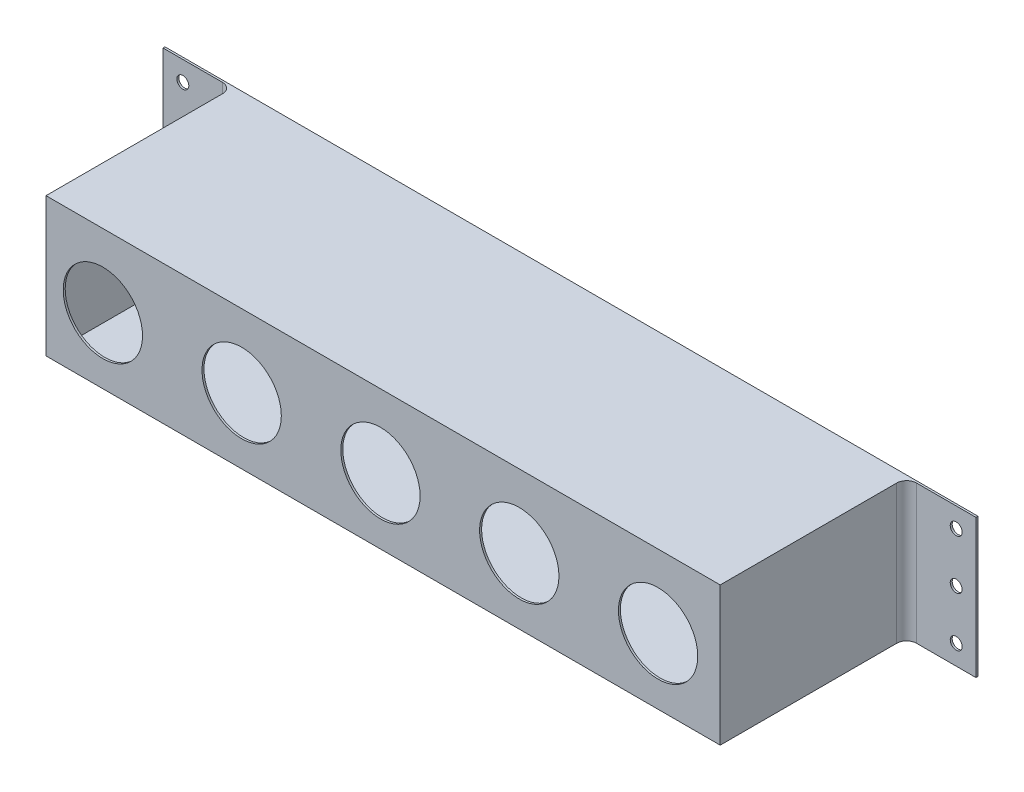
ISO-10303-21;
HEADER;
FILE_DESCRIPTION(('STEP AP214'),'2;1');
FILE_NAME('part.step','',(''),(''),'','','');
FILE_SCHEMA(('AUTOMOTIVE_DESIGN { 1 0 10303 214 1 1 1 1 }'));
ENDSEC;
DATA;
#1=APPLICATION_CONTEXT('core data for automotive mechanical design processes');
#2=APPLICATION_PROTOCOL_DEFINITION('international standard','automotive_design',2000,#1);
#3=PRODUCT_CONTEXT('',#1,'mechanical');
#4=PRODUCT('Part','Part','',(#3));
#5=PRODUCT_RELATED_PRODUCT_CATEGORY('part','',(#4));
#6=PRODUCT_DEFINITION_FORMATION('','',#4);
#7=PRODUCT_DEFINITION_CONTEXT('part definition',#1,'design');
#8=PRODUCT_DEFINITION('design','',#6,#7);
#9=PRODUCT_DEFINITION_SHAPE('','',#8);
#10=(LENGTH_UNIT() NAMED_UNIT(*) SI_UNIT(.MILLI.,.METRE.));
#11=(NAMED_UNIT(*) PLANE_ANGLE_UNIT() SI_UNIT($,.RADIAN.));
#12=(NAMED_UNIT(*) SI_UNIT($,.STERADIAN.) SOLID_ANGLE_UNIT());
#13=UNCERTAINTY_MEASURE_WITH_UNIT(LENGTH_MEASURE(1.E-05),#10,'distance_accuracy_value','');
#14=(GEOMETRIC_REPRESENTATION_CONTEXT(3) GLOBAL_UNCERTAINTY_ASSIGNED_CONTEXT((#13)) GLOBAL_UNIT_ASSIGNED_CONTEXT((#10,
#11,#12)) REPRESENTATION_CONTEXT('',''));
#15=CARTESIAN_POINT('',(0.,0.,0.));
#16=DIRECTION('',(0.,0.,1.));
#17=DIRECTION('',(1.,0.,0.));
#18=AXIS2_PLACEMENT_3D('',#15,#16,#17);
#19=CARTESIAN_POINT('',(0.,0.,0.));
#20=DIRECTION('',(0.,0.,-1.));
#21=DIRECTION('',(-1.,0.,0.));
#22=AXIS2_PLACEMENT_3D('',#19,#20,#21);
#23=PLANE('',#22);
#24=CARTESIAN_POINT('',(-195.,-25.0000000000002,0.));
#25=DIRECTION('',(0.,0.,1.));
#26=DIRECTION('',(1.,0.,0.));
#27=AXIS2_PLACEMENT_3D('',#24,#25,#26);
#28=CIRCLE('',#27,2.99999999999999);
#29=CARTESIAN_POINT('',(-192.,-25.0000000000002,0.));
#30=VERTEX_POINT('',#29);
#31=EDGE_CURVE('E281',#30,#30,#28,.T.);
#32=ORIENTED_EDGE('',*,*,#31,.T.);
#33=EDGE_LOOP('',(#32));
#34=FACE_BOUND('',#33,.T.);
#35=CARTESIAN_POINT('',(-195.,24.9999999999998,0.));
#36=DIRECTION('',(0.,0.,1.));
#37=DIRECTION('',(-1.,0.,0.));
#38=AXIS2_PLACEMENT_3D('',#35,#36,#37);
#39=CIRCLE('',#38,2.99999999999999);
#40=CARTESIAN_POINT('',(-198.,24.9999999999998,0.));
#41=VERTEX_POINT('',#40);
#42=EDGE_CURVE('E287',#41,#41,#39,.T.);
#43=ORIENTED_EDGE('',*,*,#42,.T.);
#44=EDGE_LOOP('',(#43));
#45=FACE_BOUND('',#44,.T.);
#46=CARTESIAN_POINT('',(-195.,-1.59594559789866E-13,0.));
#47=DIRECTION('',(0.,0.,1.));
#48=DIRECTION('',(-1.,0.,0.));
#49=AXIS2_PLACEMENT_3D('',#46,#47,#48);
#50=CIRCLE('',#49,3.00000000000005);
#51=CARTESIAN_POINT('',(-198.,-1.59594559789866E-13,0.));
#52=VERTEX_POINT('',#51);
#53=EDGE_CURVE('E293',#52,#52,#50,.T.);
#54=ORIENTED_EDGE('',*,*,#53,.T.);
#55=EDGE_LOOP('',(#54));
#56=FACE_BOUND('',#55,.T.);
#57=CARTESIAN_POINT('',(195.,0.,0.));
#58=DIRECTION('',(0.,0.,1.));
#59=DIRECTION('',(1.,0.,0.));
#60=AXIS2_PLACEMENT_3D('',#57,#58,#59);
#61=CIRCLE('',#60,2.99999999999999);
#62=CARTESIAN_POINT('',(198.,0.,0.));
#63=VERTEX_POINT('',#62);
#64=EDGE_CURVE('E299',#63,#63,#61,.T.);
#65=ORIENTED_EDGE('',*,*,#64,.T.);
#66=EDGE_LOOP('',(#65));
#67=FACE_BOUND('',#66,.T.);
#68=CARTESIAN_POINT('',(195.,-25.,0.));
#69=DIRECTION('',(0.,0.,1.));
#70=DIRECTION('',(-1.,0.,0.));
#71=AXIS2_PLACEMENT_3D('',#68,#69,#70);
#72=CIRCLE('',#71,2.99999999999999);
#73=CARTESIAN_POINT('',(192.,-25.,0.));
#74=VERTEX_POINT('',#73);
#75=EDGE_CURVE('E305',#74,#74,#72,.T.);
#76=ORIENTED_EDGE('',*,*,#75,.T.);
#77=EDGE_LOOP('',(#76));
#78=FACE_BOUND('',#77,.T.);
#79=CARTESIAN_POINT('',(195.,25.,0.));
#80=DIRECTION('',(0.,0.,1.));
#81=DIRECTION('',(1.,0.,0.));
#82=AXIS2_PLACEMENT_3D('',#79,#80,#81);
#83=CIRCLE('',#82,2.99999999999999);
#84=CARTESIAN_POINT('',(198.,25.,0.));
#85=VERTEX_POINT('',#84);
#86=EDGE_CURVE('E311',#85,#85,#83,.T.);
#87=ORIENTED_EDGE('',*,*,#86,.T.);
#88=EDGE_LOOP('',(#87));
#89=FACE_BOUND('',#88,.T.);
#90=DIRECTION('',(0.,1.,0.));
#91=VECTOR('',#90,1.);
#92=CARTESIAN_POINT('',(205.,-35.,0.));
#93=LINE('',#92,#91);
#94=CARTESIAN_POINT('',(205.,-35.,0.));
#95=VERTEX_POINT('',#94);
#96=CARTESIAN_POINT('',(205.,35.,0.));
#97=VERTEX_POINT('',#96);
#98=EDGE_CURVE('E199',#95,#97,#93,.T.);
#99=ORIENTED_EDGE('',*,*,#98,.F.);
#100=DIRECTION('',(1.,0.,0.));
#101=VECTOR('',#100,1.);
#102=CARTESIAN_POINT('',(-205.,-35.,0.));
#103=LINE('',#102,#101);
#104=CARTESIAN_POINT('',(-205.,-35.,0.));
#105=VERTEX_POINT('',#104);
#106=EDGE_CURVE('E204',#105,#95,#103,.T.);
#107=ORIENTED_EDGE('',*,*,#106,.F.);
#108=DIRECTION('',(0.,-1.,0.));
#109=VECTOR('',#108,1.);
#110=CARTESIAN_POINT('',(-205.,-35.,0.));
#111=LINE('',#110,#109);
#112=CARTESIAN_POINT('',(-205.,35.,0.));
#113=VERTEX_POINT('',#112);
#114=EDGE_CURVE('E213',#113,#105,#111,.T.);
#115=ORIENTED_EDGE('',*,*,#114,.F.);
#116=DIRECTION('',(-1.,0.,0.));
#117=VECTOR('',#116,1.);
#118=CARTESIAN_POINT('',(-205.,35.,0.));
#119=LINE('',#118,#117);
#120=EDGE_CURVE('E210',#97,#113,#119,.T.);
#121=ORIENTED_EDGE('',*,*,#120,.F.);
#122=EDGE_LOOP('',(#99,#107,#115,#121));
#123=FACE_BOUND('',#122,.T.);
#124=DIRECTION('',(0.,1.,0.));
#125=VECTOR('',#124,1.);
#126=CARTESIAN_POINT('',(169.,-60.,0.));
#127=LINE('',#126,#125);
#128=CARTESIAN_POINT('',(169.,-34.,0.));
#129=VERTEX_POINT('',#128);
#130=CARTESIAN_POINT('',(169.,34.,0.));
#131=VERTEX_POINT('',#130);
#132=EDGE_CURVE('E148',#129,#131,#127,.T.);
#133=ORIENTED_EDGE('',*,*,#132,.T.);
#134=DIRECTION('',(-1.,0.,0.));
#135=VECTOR('',#134,1.);
#136=CARTESIAN_POINT('',(0.,34.,0.));
#137=LINE('',#136,#135);
#138=CARTESIAN_POINT('',(-169.,34.,0.));
#139=VERTEX_POINT('',#138);
#140=EDGE_CURVE('E145',#131,#139,#137,.T.);
#141=ORIENTED_EDGE('',*,*,#140,.T.);
#142=DIRECTION('',(0.,1.,0.));
#143=VECTOR('',#142,1.);
#144=CARTESIAN_POINT('',(-169.,-60.,0.));
#145=LINE('',#144,#143);
#146=CARTESIAN_POINT('',(-169.,-34.,0.));
#147=VERTEX_POINT('',#146);
#148=EDGE_CURVE('E175',#147,#139,#145,.T.);
#149=ORIENTED_EDGE('',*,*,#148,.F.);
#150=DIRECTION('',(1.,0.,0.));
#151=VECTOR('',#150,1.);
#152=CARTESIAN_POINT('',(0.,-34.,0.));
#153=LINE('',#152,#151);
#154=EDGE_CURVE('E165',#147,#129,#153,.T.);
#155=ORIENTED_EDGE('',*,*,#154,.T.);
#156=EDGE_LOOP('',(#133,#141,#149,#155));
#157=FACE_BOUND('',#156,.T.);
#158=ADVANCED_FACE('F36',(#34,#45,#56,#67,#78,#89,#123,#157),#23,.T.);
#159=CARTESIAN_POINT('',(205.,-35.,95.));
#160=DIRECTION('',(-1.,0.,0.));
#161=DIRECTION('',(0.,0.,1.));
#162=AXIS2_PLACEMENT_3D('',#159,#160,#161);
#163=PLANE('',#162);
#164=DIRECTION('',(0.,0.,-1.));
#165=VECTOR('',#164,1.);
#166=CARTESIAN_POINT('',(205.,35.,95.));
#167=LINE('',#166,#165);
#168=CARTESIAN_POINT('',(205.,35.,1.));
#169=VERTEX_POINT('',#168);
#170=EDGE_CURVE('E223',#169,#97,#167,.T.);
#171=ORIENTED_EDGE('',*,*,#170,.F.);
#172=DIRECTION('',(0.,1.,0.));
#173=VECTOR('',#172,1.);
#174=CARTESIAN_POINT('',(205.,-60.,1.));
#175=LINE('',#174,#173);
#176=CARTESIAN_POINT('',(205.,-35.,1.));
#177=VERTEX_POINT('',#176);
#178=EDGE_CURVE('E195',#177,#169,#175,.T.);
#179=ORIENTED_EDGE('',*,*,#178,.F.);
#180=DIRECTION('',(0.,0.,-1.));
#181=VECTOR('',#180,1.);
#182=CARTESIAN_POINT('',(205.,-35.,95.));
#183=LINE('',#182,#181);
#184=EDGE_CURVE('E207',#177,#95,#183,.T.);
#185=ORIENTED_EDGE('',*,*,#184,.T.);
#186=ORIENTED_EDGE('',*,*,#98,.T.);
#187=EDGE_LOOP('',(#171,#179,#185,#186));
#188=FACE_BOUND('',#187,.T.);
#189=ADVANCED_FACE('F363',(#188),#163,.F.);
#190=CARTESIAN_POINT('',(-205.,35.,95.));
#191=DIRECTION('',(0.,-1.,0.));
#192=DIRECTION('',(0.,0.,-1.));
#193=AXIS2_PLACEMENT_3D('',#190,#191,#192);
#194=PLANE('',#193);
#195=DIRECTION('',(0.,0.,-1.));
#196=VECTOR('',#195,1.);
#197=CARTESIAN_POINT('',(-205.,35.,95.));
#198=LINE('',#197,#196);
#199=CARTESIAN_POINT('',(-205.,35.,1.00000000000012));
#200=VERTEX_POINT('',#199);
#201=EDGE_CURVE('E221',#200,#113,#198,.T.);
#202=ORIENTED_EDGE('',*,*,#201,.F.);
#203=DIRECTION('',(-1.,0.,0.));
#204=VECTOR('',#203,1.);
#205=CARTESIAN_POINT('',(-170.,35.,1.0000000000001));
#206=LINE('',#205,#204);
#207=CARTESIAN_POINT('',(-175.,35.,1.0000000000001));
#208=VERTEX_POINT('',#207);
#209=EDGE_CURVE('E177',#208,#200,#206,.T.);
#210=ORIENTED_EDGE('',*,*,#209,.F.);
#211=CARTESIAN_POINT('',(-175.,35.,6.0000000000001));
#212=DIRECTION('',(0.,-1.,0.));
#213=DIRECTION('',(0.,0.,-1.));
#214=AXIS2_PLACEMENT_3D('',#211,#212,#213);
#215=CIRCLE('',#214,5.);
#216=CARTESIAN_POINT('',(-170.,35.,6.0000000000001));
#217=VERTEX_POINT('',#216);
#218=EDGE_CURVE('E45',#208,#217,#215,.T.);
#219=ORIENTED_EDGE('',*,*,#218,.T.);
#220=DIRECTION('',(0.,0.,-1.));
#221=VECTOR('',#220,1.);
#222=CARTESIAN_POINT('',(-170.,35.,95.0000000000001));
#223=LINE('',#222,#221);
#224=CARTESIAN_POINT('',(-170.,35.,95.0000000000001));
#225=VERTEX_POINT('',#224);
#226=EDGE_CURVE('E183',#225,#217,#223,.T.);
#227=ORIENTED_EDGE('',*,*,#226,.F.);
#228=DIRECTION('',(-1.,0.,0.));
#229=VECTOR('',#228,1.);
#230=CARTESIAN_POINT('',(-205.,35.,95.));
#231=LINE('',#230,#229);
#232=CARTESIAN_POINT('',(170.,35.,95.));
#233=VERTEX_POINT('',#232);
#234=EDGE_CURVE('E200',#233,#225,#231,.T.);
#235=ORIENTED_EDGE('',*,*,#234,.F.);
#236=DIRECTION('',(0.,0.,1.));
#237=VECTOR('',#236,1.);
#238=CARTESIAN_POINT('',(170.,35.,95.));
#239=LINE('',#238,#237);
#240=CARTESIAN_POINT('',(170.,35.,6.00000000000001));
#241=VERTEX_POINT('',#240);
#242=EDGE_CURVE('E193',#241,#233,#239,.T.);
#243=ORIENTED_EDGE('',*,*,#242,.F.);
#244=CARTESIAN_POINT('',(175.,35.,6.00000000000001));
#245=DIRECTION('',(0.,-1.,0.));
#246=DIRECTION('',(0.,0.,-1.));
#247=AXIS2_PLACEMENT_3D('',#244,#245,#246);
#248=CIRCLE('',#247,5.);
#249=CARTESIAN_POINT('',(175.,35.,1.));
#250=VERTEX_POINT('',#249);
#251=EDGE_CURVE('E245',#241,#250,#248,.T.);
#252=ORIENTED_EDGE('',*,*,#251,.T.);
#253=DIRECTION('',(-1.,0.,0.));
#254=VECTOR('',#253,1.);
#255=CARTESIAN_POINT('',(170.,35.,1.));
#256=LINE('',#255,#254);
#257=EDGE_CURVE('E190',#169,#250,#256,.T.);
#258=ORIENTED_EDGE('',*,*,#257,.F.);
#259=ORIENTED_EDGE('',*,*,#170,.T.);
#260=ORIENTED_EDGE('',*,*,#120,.T.);
#261=EDGE_LOOP('',(#202,#210,#219,#227,#235,#243,#252,#258,#259,#260));
#262=FACE_BOUND('',#261,.T.);
#263=ADVANCED_FACE('F344',(#262),#194,.F.);
#264=CARTESIAN_POINT('',(-205.,-35.,95.));
#265=DIRECTION('',(1.,0.,0.));
#266=DIRECTION('',(0.,0.,-1.));
#267=AXIS2_PLACEMENT_3D('',#264,#265,#266);
#268=PLANE('',#267);
#269=DIRECTION('',(0.,0.,-1.));
#270=VECTOR('',#269,1.);
#271=CARTESIAN_POINT('',(-205.,-35.,95.));
#272=LINE('',#271,#270);
#273=CARTESIAN_POINT('',(-205.,-35.,1.00000000000012));
#274=VERTEX_POINT('',#273);
#275=EDGE_CURVE('E219',#274,#105,#272,.T.);
#276=ORIENTED_EDGE('',*,*,#275,.F.);
#277=DIRECTION('',(0.,1.,0.));
#278=VECTOR('',#277,1.);
#279=CARTESIAN_POINT('',(-205.,-60.,1.00000000000012));
#280=LINE('',#279,#278);
#281=EDGE_CURVE('E185',#274,#200,#280,.T.);
#282=ORIENTED_EDGE('',*,*,#281,.T.);
#283=ORIENTED_EDGE('',*,*,#201,.T.);
#284=ORIENTED_EDGE('',*,*,#114,.T.);
#285=EDGE_LOOP('',(#276,#282,#283,#284));
#286=FACE_BOUND('',#285,.T.);
#287=ADVANCED_FACE('F355',(#286),#268,.F.);
#288=CARTESIAN_POINT('',(-205.,-35.,95.));
#289=DIRECTION('',(0.,1.,0.));
#290=DIRECTION('',(0.,0.,1.));
#291=AXIS2_PLACEMENT_3D('',#288,#289,#290);
#292=PLANE('',#291);
#293=DIRECTION('',(0.,0.,-1.));
#294=VECTOR('',#293,1.);
#295=CARTESIAN_POINT('',(-170.,-35.,95.));
#296=LINE('',#295,#294);
#297=CARTESIAN_POINT('',(-170.,-35.,95.));
#298=VERTEX_POINT('',#297);
#299=CARTESIAN_POINT('',(-170.,-35.,6.0000000000001));
#300=VERTEX_POINT('',#299);
#301=EDGE_CURVE('E188',#298,#300,#296,.T.);
#302=ORIENTED_EDGE('',*,*,#301,.T.);
#303=CARTESIAN_POINT('',(-175.,-35.,6.0000000000001));
#304=DIRECTION('',(0.,1.,0.));
#305=DIRECTION('',(0.,0.,1.));
#306=AXIS2_PLACEMENT_3D('',#303,#304,#305);
#307=CIRCLE('',#306,5.);
#308=CARTESIAN_POINT('',(-175.,-35.,1.00000000000009));
#309=VERTEX_POINT('',#308);
#310=EDGE_CURVE('E11',#300,#309,#307,.T.);
#311=ORIENTED_EDGE('',*,*,#310,.T.);
#312=DIRECTION('',(-1.,0.,0.));
#313=VECTOR('',#312,1.);
#314=CARTESIAN_POINT('',(-205.,-35.,1.00000000000011));
#315=LINE('',#314,#313);
#316=EDGE_CURVE('E234',#309,#274,#315,.T.);
#317=ORIENTED_EDGE('',*,*,#316,.T.);
#318=ORIENTED_EDGE('',*,*,#275,.T.);
#319=ORIENTED_EDGE('',*,*,#106,.T.);
#320=ORIENTED_EDGE('',*,*,#184,.F.);
#321=DIRECTION('',(-1.,0.,0.));
#322=VECTOR('',#321,1.);
#323=CARTESIAN_POINT('',(-205.,-35.,1.));
#324=LINE('',#323,#322);
#325=CARTESIAN_POINT('',(175.,-35.,1.));
#326=VERTEX_POINT('',#325);
#327=EDGE_CURVE('E228',#177,#326,#324,.T.);
#328=ORIENTED_EDGE('',*,*,#327,.T.);
#329=CARTESIAN_POINT('',(175.,-35.,6.00000000000001));
#330=DIRECTION('',(0.,1.,0.));
#331=DIRECTION('',(0.,0.,1.));
#332=AXIS2_PLACEMENT_3D('',#329,#330,#331);
#333=CIRCLE('',#332,5.);
#334=CARTESIAN_POINT('',(170.,-35.,6.00000000000001));
#335=VERTEX_POINT('',#334);
#336=EDGE_CURVE('E247',#326,#335,#333,.T.);
#337=ORIENTED_EDGE('',*,*,#336,.T.);
#338=DIRECTION('',(0.,0.,1.));
#339=VECTOR('',#338,1.);
#340=CARTESIAN_POINT('',(170.,-35.,95.));
#341=LINE('',#340,#339);
#342=CARTESIAN_POINT('',(170.,-35.,95.));
#343=VERTEX_POINT('',#342);
#344=EDGE_CURVE('E197',#335,#343,#341,.T.);
#345=ORIENTED_EDGE('',*,*,#344,.T.);
#346=DIRECTION('',(1.,0.,0.));
#347=VECTOR('',#346,1.);
#348=CARTESIAN_POINT('',(-205.,-35.,95.));
#349=LINE('',#348,#347);
#350=EDGE_CURVE('E203',#298,#343,#349,.T.);
#351=ORIENTED_EDGE('',*,*,#350,.F.);
#352=EDGE_LOOP('',(#302,#311,#317,#318,#319,#320,#328,#337,#345,#351));
#353=FACE_BOUND('',#352,.T.);
#354=ADVANCED_FACE('F335',(#353),#292,.F.);
#355=CARTESIAN_POINT('',(0.,0.,95.));
#356=DIRECTION('',(0.,0.,-1.));
#357=DIRECTION('',(-1.,0.,0.));
#358=AXIS2_PLACEMENT_3D('',#355,#356,#357);
#359=PLANE('',#358);
#360=CARTESIAN_POINT('',(138.67,-1.84000000000002,95.));
#361=DIRECTION('',(0.,0.,1.));
#362=DIRECTION('',(1.,0.,0.));
#363=AXIS2_PLACEMENT_3D('',#360,#361,#362);
#364=CIRCLE('',#363,20.);
#365=CARTESIAN_POINT('',(158.67,-1.84000000000002,95.));
#366=VERTEX_POINT('',#365);
#367=EDGE_CURVE('E274',#366,#366,#364,.T.);
#368=ORIENTED_EDGE('',*,*,#367,.F.);
#369=EDGE_LOOP('',(#368));
#370=FACE_BOUND('',#369,.T.);
#371=CARTESIAN_POINT('',(68.6700000000001,-1.84000000000002,95.));
#372=DIRECTION('',(0.,0.,1.));
#373=DIRECTION('',(1.,0.,0.));
#374=AXIS2_PLACEMENT_3D('',#371,#372,#373);
#375=CIRCLE('',#374,20.);
#376=CARTESIAN_POINT('',(88.6700000000001,-1.84000000000002,95.));
#377=VERTEX_POINT('',#376);
#378=EDGE_CURVE('E264',#377,#377,#375,.T.);
#379=ORIENTED_EDGE('',*,*,#378,.F.);
#380=EDGE_LOOP('',(#379));
#381=FACE_BOUND('',#380,.T.);
#382=CARTESIAN_POINT('',(-1.32999999999991,-1.84000000000002,95.));
#383=DIRECTION('',(0.,0.,1.));
#384=DIRECTION('',(1.,0.,0.));
#385=AXIS2_PLACEMENT_3D('',#382,#383,#384);
#386=CIRCLE('',#385,20.);
#387=CARTESIAN_POINT('',(18.6700000000001,-1.84000000000002,95.));
#388=VERTEX_POINT('',#387);
#389=EDGE_CURVE('E261',#388,#388,#386,.T.);
#390=ORIENTED_EDGE('',*,*,#389,.F.);
#391=EDGE_LOOP('',(#390));
#392=FACE_BOUND('',#391,.T.);
#393=CARTESIAN_POINT('',(-71.3299999999999,-1.84000000000002,95.));
#394=DIRECTION('',(0.,0.,1.));
#395=DIRECTION('',(1.,0.,0.));
#396=AXIS2_PLACEMENT_3D('',#393,#394,#395);
#397=CIRCLE('',#396,20.);
#398=CARTESIAN_POINT('',(-51.3299999999999,-1.84000000000002,95.));
#399=VERTEX_POINT('',#398);
#400=EDGE_CURVE('E258',#399,#399,#397,.T.);
#401=ORIENTED_EDGE('',*,*,#400,.F.);
#402=EDGE_LOOP('',(#401));
#403=FACE_BOUND('',#402,.T.);
#404=CARTESIAN_POINT('',(-141.33,-1.84000000000002,95.));
#405=DIRECTION('',(0.,0.,1.));
#406=DIRECTION('',(1.,0.,0.));
#407=AXIS2_PLACEMENT_3D('',#404,#405,#406);
#408=CIRCLE('',#407,20.);
#409=CARTESIAN_POINT('',(-121.33,-1.84000000000002,95.));
#410=VERTEX_POINT('',#409);
#411=EDGE_CURVE('E254',#410,#410,#408,.T.);
#412=ORIENTED_EDGE('',*,*,#411,.F.);
#413=EDGE_LOOP('',(#412));
#414=FACE_BOUND('',#413,.T.);
#415=ORIENTED_EDGE('',*,*,#234,.T.);
#416=DIRECTION('',(0.,-1.,0.));
#417=VECTOR('',#416,1.);
#418=CARTESIAN_POINT('',(-170.,0.,95.));
#419=LINE('',#418,#417);
#420=EDGE_CURVE('E231',#225,#298,#419,.T.);
#421=ORIENTED_EDGE('',*,*,#420,.T.);
#422=ORIENTED_EDGE('',*,*,#350,.T.);
#423=DIRECTION('',(0.,1.,0.));
#424=VECTOR('',#423,1.);
#425=CARTESIAN_POINT('',(170.,0.,95.));
#426=LINE('',#425,#424);
#427=EDGE_CURVE('E225',#343,#233,#426,.T.);
#428=ORIENTED_EDGE('',*,*,#427,.T.);
#429=EDGE_LOOP('',(#415,#421,#422,#428));
#430=FACE_BOUND('',#429,.T.);
#431=ADVANCED_FACE('F322',(#370,#381,#392,#403,#414,#430),#359,.F.);
#432=CARTESIAN_POINT('',(170.,-60.,1.));
#433=DIRECTION('',(0.,0.,-1.));
#434=DIRECTION('',(-1.,0.,0.));
#435=AXIS2_PLACEMENT_3D('',#432,#433,#434);
#436=PLANE('',#435);
#437=CARTESIAN_POINT('',(195.,0.,1.));
#438=DIRECTION('',(0.,0.,1.));
#439=DIRECTION('',(1.,0.,0.));
#440=AXIS2_PLACEMENT_3D('',#437,#438,#439);
#441=CIRCLE('',#440,2.99999999999999);
#442=CARTESIAN_POINT('',(198.,0.,1.));
#443=VERTEX_POINT('',#442);
#444=EDGE_CURVE('E296',#443,#443,#441,.T.);
#445=ORIENTED_EDGE('',*,*,#444,.F.);
#446=EDGE_LOOP('',(#445));
#447=FACE_BOUND('',#446,.T.);
#448=CARTESIAN_POINT('',(195.,-25.,1.));
#449=DIRECTION('',(0.,0.,1.));
#450=DIRECTION('',(-1.,0.,0.));
#451=AXIS2_PLACEMENT_3D('',#448,#449,#450);
#452=CIRCLE('',#451,2.99999999999999);
#453=CARTESIAN_POINT('',(192.,-25.,1.));
#454=VERTEX_POINT('',#453);
#455=EDGE_CURVE('E302',#454,#454,#452,.T.);
#456=ORIENTED_EDGE('',*,*,#455,.F.);
#457=EDGE_LOOP('',(#456));
#458=FACE_BOUND('',#457,.T.);
#459=CARTESIAN_POINT('',(195.,25.,1.));
#460=DIRECTION('',(0.,0.,1.));
#461=DIRECTION('',(1.,0.,0.));
#462=AXIS2_PLACEMENT_3D('',#459,#460,#461);
#463=CIRCLE('',#462,2.99999999999999);
#464=CARTESIAN_POINT('',(198.,25.,1.));
#465=VERTEX_POINT('',#464);
#466=EDGE_CURVE('E308',#465,#465,#463,.T.);
#467=ORIENTED_EDGE('',*,*,#466,.F.);
#468=EDGE_LOOP('',(#467));
#469=FACE_BOUND('',#468,.T.);
#470=ORIENTED_EDGE('',*,*,#257,.T.);
#471=DIRECTION('',(0.,1.,0.));
#472=VECTOR('',#471,1.);
#473=CARTESIAN_POINT('',(175.,-35.,1.));
#474=LINE('',#473,#472);
#475=EDGE_CURVE('E239',#250,#326,#474,.F.);
#476=ORIENTED_EDGE('',*,*,#475,.T.);
#477=ORIENTED_EDGE('',*,*,#327,.F.);
#478=ORIENTED_EDGE('',*,*,#178,.T.);
#479=EDGE_LOOP('',(#470,#476,#477,#478));
#480=FACE_BOUND('',#479,.T.);
#481=ADVANCED_FACE('F318',(#447,#458,#469,#480),#436,.F.);
#482=CARTESIAN_POINT('',(170.,-60.,95.));
#483=DIRECTION('',(-1.,0.,0.));
#484=DIRECTION('',(0.,0.,1.));
#485=AXIS2_PLACEMENT_3D('',#482,#483,#484);
#486=PLANE('',#485);
#487=ORIENTED_EDGE('',*,*,#344,.F.);
#488=DIRECTION('',(0.,1.,0.));
#489=VECTOR('',#488,1.);
#490=CARTESIAN_POINT('',(170.,35.,6.00000000000001));
#491=LINE('',#490,#489);
#492=EDGE_CURVE('E236',#335,#241,#491,.T.);
#493=ORIENTED_EDGE('',*,*,#492,.T.);
#494=ORIENTED_EDGE('',*,*,#242,.T.);
#495=ORIENTED_EDGE('',*,*,#427,.F.);
#496=EDGE_LOOP('',(#487,#493,#494,#495));
#497=FACE_BOUND('',#496,.T.);
#498=ADVANCED_FACE('F321',(#497),#486,.F.);
#499=CARTESIAN_POINT('',(-170.,-60.,1.0000000000001));
#500=DIRECTION('',(0.,0.,-1.));
#501=DIRECTION('',(-1.,0.,0.));
#502=AXIS2_PLACEMENT_3D('',#499,#500,#501);
#503=PLANE('',#502);
#504=CARTESIAN_POINT('',(-195.,-25.0000000000002,1.));
#505=DIRECTION('',(0.,0.,1.));
#506=DIRECTION('',(1.,0.,0.));
#507=AXIS2_PLACEMENT_3D('',#504,#505,#506);
#508=CIRCLE('',#507,2.99999999999999);
#509=CARTESIAN_POINT('',(-192.,-25.0000000000002,1.));
#510=VERTEX_POINT('',#509);
#511=EDGE_CURVE('E253',#510,#510,#508,.T.);
#512=ORIENTED_EDGE('',*,*,#511,.F.);
#513=EDGE_LOOP('',(#512));
#514=FACE_BOUND('',#513,.T.);
#515=CARTESIAN_POINT('',(-195.,24.9999999999998,1.));
#516=DIRECTION('',(0.,0.,1.));
#517=DIRECTION('',(-1.,0.,0.));
#518=AXIS2_PLACEMENT_3D('',#515,#516,#517);
#519=CIRCLE('',#518,2.99999999999999);
#520=CARTESIAN_POINT('',(-198.,24.9999999999998,1.));
#521=VERTEX_POINT('',#520);
#522=EDGE_CURVE('E284',#521,#521,#519,.T.);
#523=ORIENTED_EDGE('',*,*,#522,.F.);
#524=EDGE_LOOP('',(#523));
#525=FACE_BOUND('',#524,.T.);
#526=CARTESIAN_POINT('',(-195.,-1.59594559789866E-13,1.));
#527=DIRECTION('',(0.,0.,1.));
#528=DIRECTION('',(-1.,0.,0.));
#529=AXIS2_PLACEMENT_3D('',#526,#527,#528);
#530=CIRCLE('',#529,3.00000000000005);
#531=CARTESIAN_POINT('',(-198.,-1.59594559789866E-13,1.));
#532=VERTEX_POINT('',#531);
#533=EDGE_CURVE('E290',#532,#532,#530,.T.);
#534=ORIENTED_EDGE('',*,*,#533,.F.);
#535=EDGE_LOOP('',(#534));
#536=FACE_BOUND('',#535,.T.);
#537=ORIENTED_EDGE('',*,*,#316,.F.);
#538=DIRECTION('',(0.,1.,0.));
#539=VECTOR('',#538,1.);
#540=CARTESIAN_POINT('',(-175.,35.,1.0000000000001));
#541=LINE('',#540,#539);
#542=EDGE_CURVE('E241',#309,#208,#541,.T.);
#543=ORIENTED_EDGE('',*,*,#542,.T.);
#544=ORIENTED_EDGE('',*,*,#209,.T.);
#545=ORIENTED_EDGE('',*,*,#281,.F.);
#546=EDGE_LOOP('',(#537,#543,#544,#545));
#547=FACE_BOUND('',#546,.T.);
#548=ADVANCED_FACE('F352',(#514,#525,#536,#547),#503,.F.);
#549=CARTESIAN_POINT('',(-170.,-60.,95.0000000000001));
#550=DIRECTION('',(1.,0.,0.));
#551=DIRECTION('',(0.,0.,-1.));
#552=AXIS2_PLACEMENT_3D('',#549,#550,#551);
#553=PLANE('',#552);
#554=ORIENTED_EDGE('',*,*,#226,.T.);
#555=DIRECTION('',(0.,1.,0.));
#556=VECTOR('',#555,1.);
#557=CARTESIAN_POINT('',(-170.,-35.,6.0000000000001));
#558=LINE('',#557,#556);
#559=EDGE_CURVE('E53',#217,#300,#558,.F.);
#560=ORIENTED_EDGE('',*,*,#559,.T.);
#561=ORIENTED_EDGE('',*,*,#301,.F.);
#562=ORIENTED_EDGE('',*,*,#420,.F.);
#563=EDGE_LOOP('',(#554,#560,#561,#562));
#564=FACE_BOUND('',#563,.T.);
#565=ADVANCED_FACE('F345',(#564),#553,.F.);
#566=CARTESIAN_POINT('',(-205.,34.,95.));
#567=DIRECTION('',(0.,-1.,0.));
#568=DIRECTION('',(0.,0.,-1.));
#569=AXIS2_PLACEMENT_3D('',#566,#567,#568);
#570=PLANE('',#569);
#571=DIRECTION('',(0.,0.,1.));
#572=VECTOR('',#571,1.);
#573=CARTESIAN_POINT('',(169.,34.,95.));
#574=LINE('',#573,#572);
#575=CARTESIAN_POINT('',(169.,34.,94.));
#576=VERTEX_POINT('',#575);
#577=EDGE_CURVE('E138',#131,#576,#574,.T.);
#578=ORIENTED_EDGE('',*,*,#577,.T.);
#579=DIRECTION('',(-1.,0.,0.));
#580=VECTOR('',#579,1.);
#581=CARTESIAN_POINT('',(0.,34.,94.));
#582=LINE('',#581,#580);
#583=CARTESIAN_POINT('',(-169.,34.,94.));
#584=VERTEX_POINT('',#583);
#585=EDGE_CURVE('E143',#576,#584,#582,.T.);
#586=ORIENTED_EDGE('',*,*,#585,.T.);
#587=DIRECTION('',(0.,0.,-1.));
#588=VECTOR('',#587,1.);
#589=CARTESIAN_POINT('',(-169.,34.,95.0000000000001));
#590=LINE('',#589,#588);
#591=EDGE_CURVE('E171',#584,#139,#590,.T.);
#592=ORIENTED_EDGE('',*,*,#591,.T.);
#593=ORIENTED_EDGE('',*,*,#140,.F.);
#594=EDGE_LOOP('',(#578,#586,#592,#593));
#595=FACE_BOUND('',#594,.T.);
#596=ADVANCED_FACE('F140',(#595),#570,.T.);
#597=CARTESIAN_POINT('',(-205.,-34.,95.));
#598=DIRECTION('',(0.,1.,0.));
#599=DIRECTION('',(0.,0.,1.));
#600=AXIS2_PLACEMENT_3D('',#597,#598,#599);
#601=PLANE('',#600);
#602=DIRECTION('',(0.,0.,-1.));
#603=VECTOR('',#602,1.);
#604=CARTESIAN_POINT('',(-169.,-34.,95.));
#605=LINE('',#604,#603);
#606=CARTESIAN_POINT('',(-169.,-34.,94.));
#607=VERTEX_POINT('',#606);
#608=EDGE_CURVE('E149',#607,#147,#605,.T.);
#609=ORIENTED_EDGE('',*,*,#608,.F.);
#610=DIRECTION('',(1.,0.,0.));
#611=VECTOR('',#610,1.);
#612=CARTESIAN_POINT('',(0.,-34.,94.));
#613=LINE('',#612,#611);
#614=CARTESIAN_POINT('',(169.,-34.,94.));
#615=VERTEX_POINT('',#614);
#616=EDGE_CURVE('E160',#607,#615,#613,.T.);
#617=ORIENTED_EDGE('',*,*,#616,.T.);
#618=DIRECTION('',(0.,0.,1.));
#619=VECTOR('',#618,1.);
#620=CARTESIAN_POINT('',(169.,-34.,95.));
#621=LINE('',#620,#619);
#622=EDGE_CURVE('E156',#129,#615,#621,.T.);
#623=ORIENTED_EDGE('',*,*,#622,.F.);
#624=ORIENTED_EDGE('',*,*,#154,.F.);
#625=EDGE_LOOP('',(#609,#617,#623,#624));
#626=FACE_BOUND('',#625,.T.);
#627=ADVANCED_FACE('F440',(#626),#601,.T.);
#628=CARTESIAN_POINT('',(0.,0.,94.));
#629=DIRECTION('',(0.,0.,-1.));
#630=DIRECTION('',(-1.,0.,0.));
#631=AXIS2_PLACEMENT_3D('',#628,#629,#630);
#632=PLANE('',#631);
#633=CARTESIAN_POINT('',(138.67,-1.84000000000002,94.));
#634=DIRECTION('',(0.,0.,-1.));
#635=DIRECTION('',(-1.,0.,0.));
#636=AXIS2_PLACEMENT_3D('',#633,#634,#635);
#637=CIRCLE('',#636,20.);
#638=CARTESIAN_POINT('',(118.67,-1.84000000000002,94.));
#639=VERTEX_POINT('',#638);
#640=EDGE_CURVE('E40',#639,#639,#637,.T.);
#641=ORIENTED_EDGE('',*,*,#640,.F.);
#642=EDGE_LOOP('',(#641));
#643=FACE_BOUND('',#642,.T.);
#644=CARTESIAN_POINT('',(68.6700000000001,-1.84000000000002,94.));
#645=DIRECTION('',(0.,0.,-1.));
#646=DIRECTION('',(-1.,0.,0.));
#647=AXIS2_PLACEMENT_3D('',#644,#645,#646);
#648=CIRCLE('',#647,20.);
#649=CARTESIAN_POINT('',(48.6700000000001,-1.84000000000002,94.));
#650=VERTEX_POINT('',#649);
#651=EDGE_CURVE('E262',#650,#650,#648,.T.);
#652=ORIENTED_EDGE('',*,*,#651,.F.);
#653=EDGE_LOOP('',(#652));
#654=FACE_BOUND('',#653,.T.);
#655=CARTESIAN_POINT('',(-1.32999999999991,-1.84000000000002,94.));
#656=DIRECTION('',(0.,0.,-1.));
#657=DIRECTION('',(-1.,0.,0.));
#658=AXIS2_PLACEMENT_3D('',#655,#656,#657);
#659=CIRCLE('',#658,20.);
#660=CARTESIAN_POINT('',(-21.3299999999999,-1.84000000000002,94.));
#661=VERTEX_POINT('',#660);
#662=EDGE_CURVE('E259',#661,#661,#659,.T.);
#663=ORIENTED_EDGE('',*,*,#662,.F.);
#664=EDGE_LOOP('',(#663));
#665=FACE_BOUND('',#664,.T.);
#666=CARTESIAN_POINT('',(-71.3299999999999,-1.84000000000002,94.));
#667=DIRECTION('',(0.,0.,-1.));
#668=DIRECTION('',(-1.,0.,0.));
#669=AXIS2_PLACEMENT_3D('',#666,#667,#668);
#670=CIRCLE('',#669,20.);
#671=CARTESIAN_POINT('',(-91.3299999999999,-1.84000000000002,94.));
#672=VERTEX_POINT('',#671);
#673=EDGE_CURVE('E255',#672,#672,#670,.T.);
#674=ORIENTED_EDGE('',*,*,#673,.F.);
#675=EDGE_LOOP('',(#674));
#676=FACE_BOUND('',#675,.T.);
#677=CARTESIAN_POINT('',(-141.33,-1.84000000000002,94.));
#678=DIRECTION('',(0.,0.,-1.));
#679=DIRECTION('',(-1.,0.,0.));
#680=AXIS2_PLACEMENT_3D('',#677,#678,#679);
#681=CIRCLE('',#680,20.);
#682=CARTESIAN_POINT('',(-161.33,-1.84000000000002,94.));
#683=VERTEX_POINT('',#682);
#684=EDGE_CURVE('E250',#683,#683,#681,.T.);
#685=ORIENTED_EDGE('',*,*,#684,.F.);
#686=EDGE_LOOP('',(#685));
#687=FACE_BOUND('',#686,.T.);
#688=ORIENTED_EDGE('',*,*,#585,.F.);
#689=DIRECTION('',(0.,1.,0.));
#690=VECTOR('',#689,1.);
#691=CARTESIAN_POINT('',(169.,0.,94.));
#692=LINE('',#691,#690);
#693=EDGE_CURVE('E153',#615,#576,#692,.T.);
#694=ORIENTED_EDGE('',*,*,#693,.F.);
#695=ORIENTED_EDGE('',*,*,#616,.F.);
#696=DIRECTION('',(0.,-1.,0.));
#697=VECTOR('',#696,1.);
#698=CARTESIAN_POINT('',(-169.,0.,94.));
#699=LINE('',#698,#697);
#700=EDGE_CURVE('E159',#584,#607,#699,.T.);
#701=ORIENTED_EDGE('',*,*,#700,.F.);
#702=EDGE_LOOP('',(#688,#694,#695,#701));
#703=FACE_BOUND('',#702,.T.);
#704=ADVANCED_FACE('F162',(#643,#654,#665,#676,#687,#703),#632,.T.);
#705=CARTESIAN_POINT('',(169.,-60.,95.));
#706=DIRECTION('',(-1.,0.,0.));
#707=DIRECTION('',(0.,0.,1.));
#708=AXIS2_PLACEMENT_3D('',#705,#706,#707);
#709=PLANE('',#708);
#710=ORIENTED_EDGE('',*,*,#132,.F.);
#711=ORIENTED_EDGE('',*,*,#622,.T.);
#712=ORIENTED_EDGE('',*,*,#693,.T.);
#713=ORIENTED_EDGE('',*,*,#577,.F.);
#714=EDGE_LOOP('',(#710,#711,#712,#713));
#715=FACE_BOUND('',#714,.T.);
#716=ADVANCED_FACE('F154',(#715),#709,.T.);
#717=CARTESIAN_POINT('',(-169.,-60.,95.0000000000001));
#718=DIRECTION('',(1.,0.,0.));
#719=DIRECTION('',(0.,0.,-1.));
#720=AXIS2_PLACEMENT_3D('',#717,#718,#719);
#721=PLANE('',#720);
#722=ORIENTED_EDGE('',*,*,#700,.T.);
#723=ORIENTED_EDGE('',*,*,#608,.T.);
#724=ORIENTED_EDGE('',*,*,#148,.T.);
#725=ORIENTED_EDGE('',*,*,#591,.F.);
#726=EDGE_LOOP('',(#722,#723,#724,#725));
#727=FACE_BOUND('',#726,.T.);
#728=ADVANCED_FACE('F375',(#727),#721,.T.);
#729=CARTESIAN_POINT('',(175.,-60.,6.00000000000001));
#730=DIRECTION('',(0.,-1.,0.));
#731=DIRECTION('',(0.,0.,-1.));
#732=AXIS2_PLACEMENT_3D('',#729,#730,#731);
#733=CYLINDRICAL_SURFACE('',#732,5.);
#734=ORIENTED_EDGE('',*,*,#336,.F.);
#735=ORIENTED_EDGE('',*,*,#475,.F.);
#736=ORIENTED_EDGE('',*,*,#251,.F.);
#737=ORIENTED_EDGE('',*,*,#492,.F.);
#738=EDGE_LOOP('',(#734,#735,#736,#737));
#739=FACE_BOUND('',#738,.T.);
#740=ADVANCED_FACE('F331',(#739),#733,.F.);
#741=CARTESIAN_POINT('',(-175.,-60.,6.0000000000001));
#742=DIRECTION('',(0.,-1.,0.));
#743=DIRECTION('',(0.,0.,-1.));
#744=AXIS2_PLACEMENT_3D('',#741,#742,#743);
#745=CYLINDRICAL_SURFACE('',#744,5.);
#746=ORIENTED_EDGE('',*,*,#310,.F.);
#747=ORIENTED_EDGE('',*,*,#559,.F.);
#748=ORIENTED_EDGE('',*,*,#218,.F.);
#749=ORIENTED_EDGE('',*,*,#542,.F.);
#750=EDGE_LOOP('',(#746,#747,#748,#749));
#751=FACE_BOUND('',#750,.T.);
#752=ADVANCED_FACE('F38',(#751),#745,.F.);
#753=CARTESIAN_POINT('',(195.,25.,0.));
#754=DIRECTION('',(0.,0.,1.));
#755=DIRECTION('',(1.,0.,0.));
#756=AXIS2_PLACEMENT_3D('',#753,#754,#755);
#757=CYLINDRICAL_SURFACE('',#756,2.99999999999999);
#758=ORIENTED_EDGE('',*,*,#86,.F.);
#759=EDGE_LOOP('',(#758));
#760=FACE_BOUND('',#759,.T.);
#761=ORIENTED_EDGE('',*,*,#466,.T.);
#762=EDGE_LOOP('',(#761));
#763=FACE_BOUND('',#762,.T.);
#764=ADVANCED_FACE('F316',(#760,#763),#757,.F.);
#765=CARTESIAN_POINT('',(195.,-25.,0.));
#766=DIRECTION('',(0.,0.,1.));
#767=DIRECTION('',(1.,0.,0.));
#768=AXIS2_PLACEMENT_3D('',#765,#766,#767);
#769=CYLINDRICAL_SURFACE('',#768,2.99999999999999);
#770=ORIENTED_EDGE('',*,*,#75,.F.);
#771=EDGE_LOOP('',(#770));
#772=FACE_BOUND('',#771,.T.);
#773=ORIENTED_EDGE('',*,*,#455,.T.);
#774=EDGE_LOOP('',(#773));
#775=FACE_BOUND('',#774,.T.);
#776=ADVANCED_FACE('F494',(#772,#775),#769,.F.);
#777=CARTESIAN_POINT('',(195.,0.,0.));
#778=DIRECTION('',(0.,0.,1.));
#779=DIRECTION('',(1.,0.,0.));
#780=AXIS2_PLACEMENT_3D('',#777,#778,#779);
#781=CYLINDRICAL_SURFACE('',#780,2.99999999999999);
#782=ORIENTED_EDGE('',*,*,#64,.F.);
#783=EDGE_LOOP('',(#782));
#784=FACE_BOUND('',#783,.T.);
#785=ORIENTED_EDGE('',*,*,#444,.T.);
#786=EDGE_LOOP('',(#785));
#787=FACE_BOUND('',#786,.T.);
#788=ADVANCED_FACE('F503',(#784,#787),#781,.F.);
#789=CARTESIAN_POINT('',(-195.,-1.59594559789866E-13,0.));
#790=DIRECTION('',(0.,0.,1.));
#791=DIRECTION('',(1.,0.,0.));
#792=AXIS2_PLACEMENT_3D('',#789,#790,#791);
#793=CYLINDRICAL_SURFACE('',#792,3.00000000000005);
#794=ORIENTED_EDGE('',*,*,#53,.F.);
#795=EDGE_LOOP('',(#794));
#796=FACE_BOUND('',#795,.T.);
#797=ORIENTED_EDGE('',*,*,#533,.T.);
#798=EDGE_LOOP('',(#797));
#799=FACE_BOUND('',#798,.T.);
#800=ADVANCED_FACE('F512',(#796,#799),#793,.F.);
#801=CARTESIAN_POINT('',(-195.,24.9999999999998,0.));
#802=DIRECTION('',(0.,0.,1.));
#803=DIRECTION('',(1.,0.,0.));
#804=AXIS2_PLACEMENT_3D('',#801,#802,#803);
#805=CYLINDRICAL_SURFACE('',#804,2.99999999999999);
#806=ORIENTED_EDGE('',*,*,#42,.F.);
#807=EDGE_LOOP('',(#806));
#808=FACE_BOUND('',#807,.T.);
#809=ORIENTED_EDGE('',*,*,#522,.T.);
#810=EDGE_LOOP('',(#809));
#811=FACE_BOUND('',#810,.T.);
#812=ADVANCED_FACE('F521',(#808,#811),#805,.F.);
#813=CARTESIAN_POINT('',(-195.,-25.0000000000002,0.));
#814=DIRECTION('',(0.,0.,1.));
#815=DIRECTION('',(1.,0.,0.));
#816=AXIS2_PLACEMENT_3D('',#813,#814,#815);
#817=CYLINDRICAL_SURFACE('',#816,2.99999999999999);
#818=ORIENTED_EDGE('',*,*,#31,.F.);
#819=EDGE_LOOP('',(#818));
#820=FACE_BOUND('',#819,.T.);
#821=ORIENTED_EDGE('',*,*,#511,.T.);
#822=EDGE_LOOP('',(#821));
#823=FACE_BOUND('',#822,.T.);
#824=ADVANCED_FACE('F530',(#820,#823),#817,.F.);
#825=CARTESIAN_POINT('',(-141.33,-1.84000000000002,0.));
#826=DIRECTION('',(0.,0.,1.));
#827=DIRECTION('',(1.,0.,0.));
#828=AXIS2_PLACEMENT_3D('',#825,#826,#827);
#829=CYLINDRICAL_SURFACE('',#828,20.);
#830=ORIENTED_EDGE('',*,*,#684,.T.);
#831=EDGE_LOOP('',(#830));
#832=FACE_BOUND('',#831,.T.);
#833=ORIENTED_EDGE('',*,*,#411,.T.);
#834=EDGE_LOOP('',(#833));
#835=FACE_BOUND('',#834,.T.);
#836=ADVANCED_FACE('F538',(#832,#835),#829,.F.);
#837=CARTESIAN_POINT('',(-71.3299999999999,-1.84000000000002,0.));
#838=DIRECTION('',(0.,0.,1.));
#839=DIRECTION('',(1.,0.,0.));
#840=AXIS2_PLACEMENT_3D('',#837,#838,#839);
#841=CYLINDRICAL_SURFACE('',#840,20.);
#842=ORIENTED_EDGE('',*,*,#673,.T.);
#843=EDGE_LOOP('',(#842));
#844=FACE_BOUND('',#843,.T.);
#845=ORIENTED_EDGE('',*,*,#400,.T.);
#846=EDGE_LOOP('',(#845));
#847=FACE_BOUND('',#846,.T.);
#848=ADVANCED_FACE('F546',(#844,#847),#841,.F.);
#849=CARTESIAN_POINT('',(-1.32999999999991,-1.84000000000002,0.));
#850=DIRECTION('',(0.,0.,1.));
#851=DIRECTION('',(1.,0.,0.));
#852=AXIS2_PLACEMENT_3D('',#849,#850,#851);
#853=CYLINDRICAL_SURFACE('',#852,20.);
#854=ORIENTED_EDGE('',*,*,#662,.T.);
#855=EDGE_LOOP('',(#854));
#856=FACE_BOUND('',#855,.T.);
#857=ORIENTED_EDGE('',*,*,#389,.T.);
#858=EDGE_LOOP('',(#857));
#859=FACE_BOUND('',#858,.T.);
#860=ADVANCED_FACE('F555',(#856,#859),#853,.F.);
#861=CARTESIAN_POINT('',(68.6700000000001,-1.84000000000002,0.));
#862=DIRECTION('',(0.,0.,1.));
#863=DIRECTION('',(1.,0.,0.));
#864=AXIS2_PLACEMENT_3D('',#861,#862,#863);
#865=CYLINDRICAL_SURFACE('',#864,20.);
#866=ORIENTED_EDGE('',*,*,#651,.T.);
#867=EDGE_LOOP('',(#866));
#868=FACE_BOUND('',#867,.T.);
#869=ORIENTED_EDGE('',*,*,#378,.T.);
#870=EDGE_LOOP('',(#869));
#871=FACE_BOUND('',#870,.T.);
#872=ADVANCED_FACE('F564',(#868,#871),#865,.F.);
#873=CARTESIAN_POINT('',(138.67,-1.84000000000002,0.));
#874=DIRECTION('',(0.,0.,1.));
#875=DIRECTION('',(1.,0.,0.));
#876=AXIS2_PLACEMENT_3D('',#873,#874,#875);
#877=CYLINDRICAL_SURFACE('',#876,20.);
#878=ORIENTED_EDGE('',*,*,#640,.T.);
#879=EDGE_LOOP('',(#878));
#880=FACE_BOUND('',#879,.T.);
#881=ORIENTED_EDGE('',*,*,#367,.T.);
#882=EDGE_LOOP('',(#881));
#883=FACE_BOUND('',#882,.T.);
#884=ADVANCED_FACE('F573',(#880,#883),#877,.F.);
#885=CLOSED_SHELL('',(#158,#189,#263,#287,#354,#431,#481,#498,#548,#565,#596,#627,#704,#716,
#728,#740,#752,#764,#776,#788,#800,#812,#824,#836,#848,#860,#872,#884));
#886=MANIFOLD_SOLID_BREP('B2',#885);
#887=ADVANCED_BREP_SHAPE_REPRESENTATION('',(#18,#886),#14);
#888=SHAPE_DEFINITION_REPRESENTATION(#9,#887);
ENDSEC;
END-ISO-10303-21;
